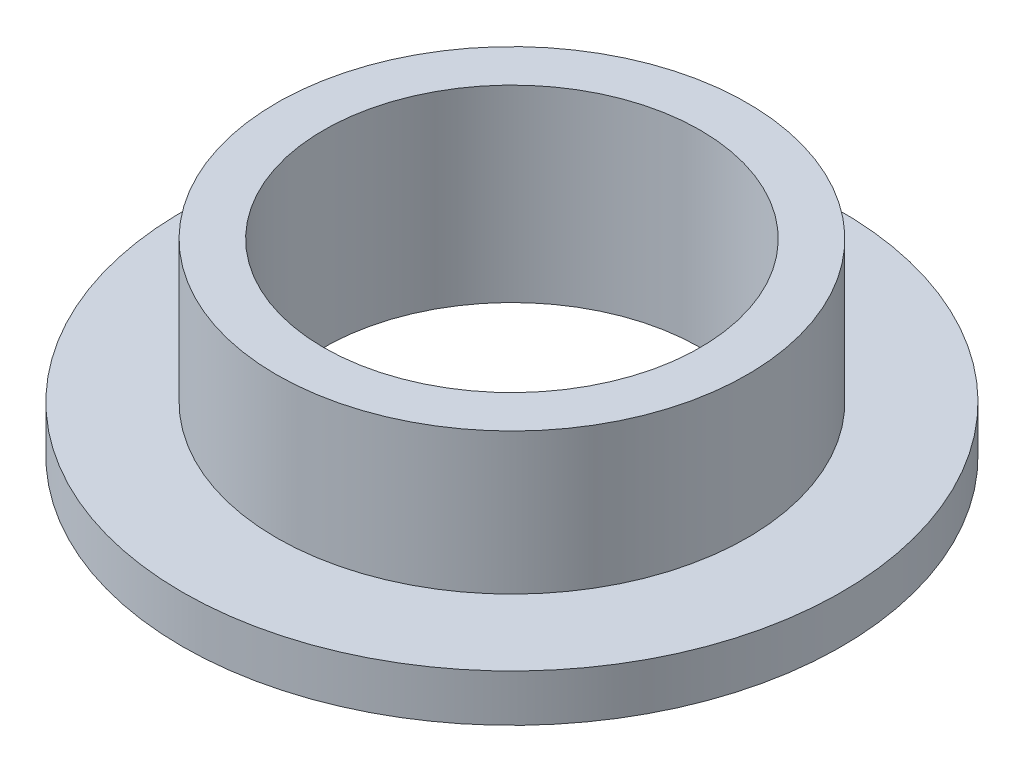
ISO-10303-21;
HEADER;
FILE_DESCRIPTION(('STEP AP214'),'2;1');
FILE_NAME('part.step','',(''),(''),'','','');
FILE_SCHEMA(('AUTOMOTIVE_DESIGN { 1 0 10303 214 1 1 1 1 }'));
ENDSEC;
DATA;
#1=APPLICATION_CONTEXT('core data for automotive mechanical design processes');
#2=APPLICATION_PROTOCOL_DEFINITION('international standard','automotive_design',2000,#1);
#3=PRODUCT_CONTEXT('',#1,'mechanical');
#4=PRODUCT('Part','Part','',(#3));
#5=PRODUCT_RELATED_PRODUCT_CATEGORY('part','',(#4));
#6=PRODUCT_DEFINITION_FORMATION('','',#4);
#7=PRODUCT_DEFINITION_CONTEXT('part definition',#1,'design');
#8=PRODUCT_DEFINITION('design','',#6,#7);
#9=PRODUCT_DEFINITION_SHAPE('','',#8);
#10=(LENGTH_UNIT() NAMED_UNIT(*) SI_UNIT(.MILLI.,.METRE.));
#11=(NAMED_UNIT(*) PLANE_ANGLE_UNIT() SI_UNIT($,.RADIAN.));
#12=(NAMED_UNIT(*) SI_UNIT($,.STERADIAN.) SOLID_ANGLE_UNIT());
#13=UNCERTAINTY_MEASURE_WITH_UNIT(LENGTH_MEASURE(1.E-05),#10,'distance_accuracy_value','');
#14=(GEOMETRIC_REPRESENTATION_CONTEXT(3) GLOBAL_UNCERTAINTY_ASSIGNED_CONTEXT((#13)) GLOBAL_UNIT_ASSIGNED_CONTEXT((#10,
#11,#12)) REPRESENTATION_CONTEXT('',''));
#15=CARTESIAN_POINT('',(0.,0.,0.));
#16=DIRECTION('',(0.,0.,1.));
#17=DIRECTION('',(1.,0.,0.));
#18=AXIS2_PLACEMENT_3D('',#15,#16,#17);
#19=CARTESIAN_POINT('',(0.,6.35,0.));
#20=DIRECTION('',(0.,1.,0.));
#21=DIRECTION('',(0.,0.,1.));
#22=AXIS2_PLACEMENT_3D('',#19,#20,#21);
#23=PLANE('',#22);
#24=CARTESIAN_POINT('',(0.,6.35,0.));
#25=DIRECTION('',(0.,1.,0.));
#26=DIRECTION('',(0.,0.,1.));
#27=AXIS2_PLACEMENT_3D('',#24,#25,#26);
#28=CIRCLE('',#27,7.9375);
#29=CARTESIAN_POINT('',(0.,6.35,7.9375));
#30=VERTEX_POINT('',#29);
#31=EDGE_CURVE('E10',#30,#30,#28,.T.);
#32=ORIENTED_EDGE('',*,*,#31,.T.);
#33=EDGE_LOOP('',(#32));
#34=FACE_BOUND('',#33,.T.);
#35=CARTESIAN_POINT('',(0.,6.35,0.));
#36=DIRECTION('',(0.,1.,0.));
#37=DIRECTION('',(0.,0.,1.));
#38=AXIS2_PLACEMENT_3D('',#35,#36,#37);
#39=CIRCLE('',#38,6.35);
#40=CARTESIAN_POINT('',(0.,6.35,6.35));
#41=VERTEX_POINT('',#40);
#42=EDGE_CURVE('E39',#41,#41,#39,.T.);
#43=ORIENTED_EDGE('',*,*,#42,.F.);
#44=EDGE_LOOP('',(#43));
#45=FACE_BOUND('',#44,.T.);
#46=ADVANCED_FACE('F32',(#34,#45),#23,.T.);
#47=CARTESIAN_POINT('',(0.,0.,0.));
#48=DIRECTION('',(0.,1.,0.));
#49=DIRECTION('',(0.,0.,1.));
#50=AXIS2_PLACEMENT_3D('',#47,#48,#49);
#51=PLANE('',#50);
#52=CARTESIAN_POINT('',(0.,0.,0.));
#53=DIRECTION('',(0.,1.,0.));
#54=DIRECTION('',(0.,0.,1.));
#55=AXIS2_PLACEMENT_3D('',#52,#53,#54);
#56=CIRCLE('',#55,6.35);
#57=CARTESIAN_POINT('',(0.,0.,6.35));
#58=VERTEX_POINT('',#57);
#59=EDGE_CURVE('E43',#58,#58,#56,.T.);
#60=ORIENTED_EDGE('',*,*,#59,.T.);
#61=EDGE_LOOP('',(#60));
#62=FACE_BOUND('',#61,.T.);
#63=CARTESIAN_POINT('',(0.,0.,0.));
#64=DIRECTION('',(0.,1.,0.));
#65=DIRECTION('',(0.,0.,1.));
#66=AXIS2_PLACEMENT_3D('',#63,#64,#65);
#67=CIRCLE('',#66,11.1125);
#68=CARTESIAN_POINT('',(0.,0.,11.1125));
#69=VERTEX_POINT('',#68);
#70=EDGE_CURVE('E50',#69,#69,#67,.T.);
#71=ORIENTED_EDGE('',*,*,#70,.F.);
#72=EDGE_LOOP('',(#71));
#73=FACE_BOUND('',#72,.T.);
#74=ADVANCED_FACE('F75',(#62,#73),#51,.F.);
#75=CARTESIAN_POINT('',(0.,6.35,0.));
#76=DIRECTION('',(0.,-1.,0.));
#77=DIRECTION('',(0.,0.,-1.));
#78=AXIS2_PLACEMENT_3D('',#75,#76,#77);
#79=CYLINDRICAL_SURFACE('',#78,7.9375);
#80=CARTESIAN_POINT('',(0.,1.5875,0.));
#81=DIRECTION('',(0.,1.,0.));
#82=DIRECTION('',(0.,0.,1.));
#83=AXIS2_PLACEMENT_3D('',#80,#81,#82);
#84=CIRCLE('',#83,7.9375);
#85=CARTESIAN_POINT('',(0.,1.5875,7.9375));
#86=VERTEX_POINT('',#85);
#87=EDGE_CURVE('E53',#86,#86,#84,.T.);
#88=ORIENTED_EDGE('',*,*,#87,.T.);
#89=EDGE_LOOP('',(#88));
#90=FACE_BOUND('',#89,.T.);
#91=ORIENTED_EDGE('',*,*,#31,.F.);
#92=EDGE_LOOP('',(#91));
#93=FACE_BOUND('',#92,.T.);
#94=ADVANCED_FACE('F34',(#90,#93),#79,.T.);
#95=CARTESIAN_POINT('',(0.,6.35,0.));
#96=DIRECTION('',(0.,-1.,0.));
#97=DIRECTION('',(0.,0.,-1.));
#98=AXIS2_PLACEMENT_3D('',#95,#96,#97);
#99=CYLINDRICAL_SURFACE('',#98,6.35);
#100=ORIENTED_EDGE('',*,*,#42,.T.);
#101=EDGE_LOOP('',(#100));
#102=FACE_BOUND('',#101,.T.);
#103=ORIENTED_EDGE('',*,*,#59,.F.);
#104=EDGE_LOOP('',(#103));
#105=FACE_BOUND('',#104,.T.);
#106=ADVANCED_FACE('F64',(#102,#105),#99,.F.);
#107=CARTESIAN_POINT('',(0.,1.5875,0.));
#108=DIRECTION('',(0.,1.,0.));
#109=DIRECTION('',(0.,0.,1.));
#110=AXIS2_PLACEMENT_3D('',#107,#108,#109);
#111=PLANE('',#110);
#112=CARTESIAN_POINT('',(0.,1.5875,0.));
#113=DIRECTION('',(0.,1.,0.));
#114=DIRECTION('',(0.,0.,1.));
#115=AXIS2_PLACEMENT_3D('',#112,#113,#114);
#116=CIRCLE('',#115,11.1125);
#117=CARTESIAN_POINT('',(0.,1.5875,11.1125));
#118=VERTEX_POINT('',#117);
#119=EDGE_CURVE('E48',#118,#118,#116,.T.);
#120=ORIENTED_EDGE('',*,*,#119,.T.);
#121=EDGE_LOOP('',(#120));
#122=FACE_BOUND('',#121,.T.);
#123=ORIENTED_EDGE('',*,*,#87,.F.);
#124=EDGE_LOOP('',(#123));
#125=FACE_BOUND('',#124,.T.);
#126=ADVANCED_FACE('F61',(#122,#125),#111,.T.);
#127=CARTESIAN_POINT('',(0.,1.5875,0.));
#128=DIRECTION('',(0.,-1.,0.));
#129=DIRECTION('',(0.,0.,-1.));
#130=AXIS2_PLACEMENT_3D('',#127,#128,#129);
#131=CYLINDRICAL_SURFACE('',#130,11.1125);
#132=ORIENTED_EDGE('',*,*,#119,.F.);
#133=EDGE_LOOP('',(#132));
#134=FACE_BOUND('',#133,.T.);
#135=ORIENTED_EDGE('',*,*,#70,.T.);
#136=EDGE_LOOP('',(#135));
#137=FACE_BOUND('',#136,.T.);
#138=ADVANCED_FACE('F63',(#134,#137),#131,.T.);
#139=CLOSED_SHELL('',(#46,#74,#94,#106,#126,#138));
#140=MANIFOLD_SOLID_BREP('B2',#139);
#141=ADVANCED_BREP_SHAPE_REPRESENTATION('',(#18,#140),#14);
#142=SHAPE_DEFINITION_REPRESENTATION(#9,#141);
ENDSEC;
END-ISO-10303-21;
